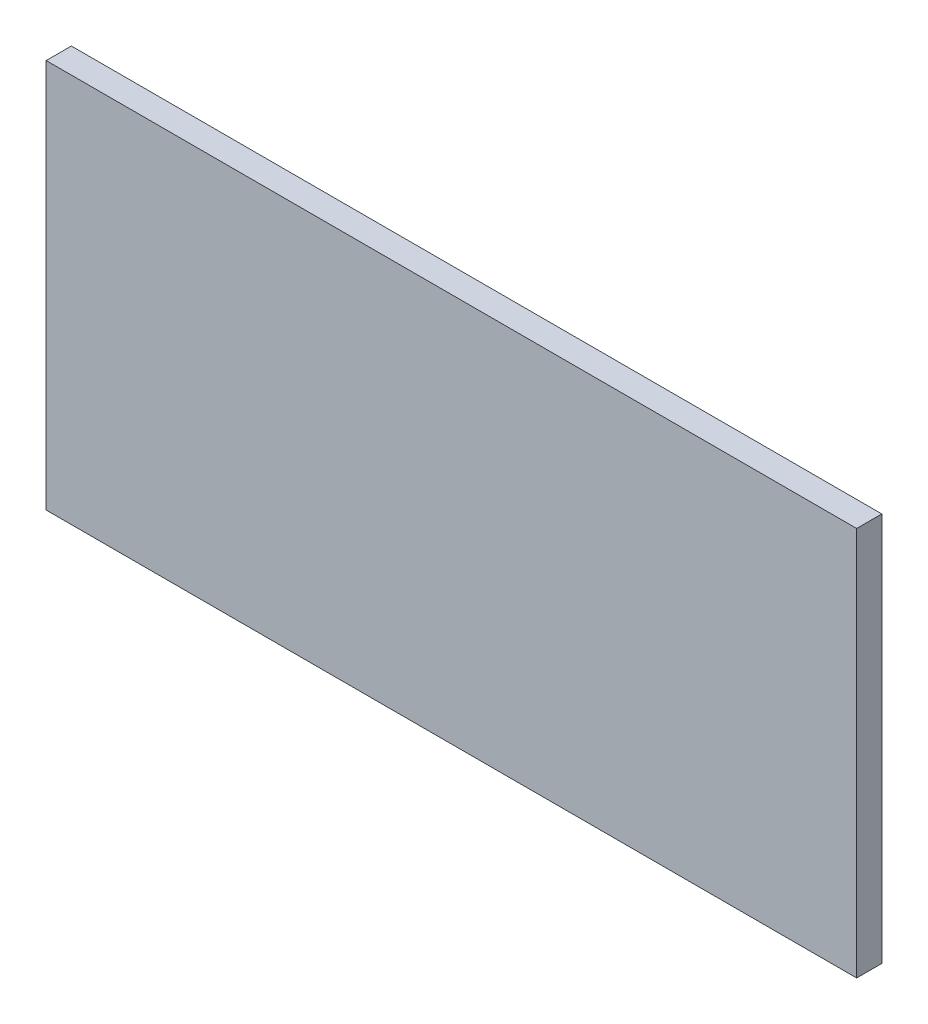
ISO-10303-21;
HEADER;
FILE_DESCRIPTION(('STEP AP214'),'2;1');
FILE_NAME('part.step','',(''),(''),'','','');
FILE_SCHEMA(('AUTOMOTIVE_DESIGN { 1 0 10303 214 1 1 1 1 }'));
ENDSEC;
DATA;
#1=APPLICATION_CONTEXT('core data for automotive mechanical design processes');
#2=APPLICATION_PROTOCOL_DEFINITION('international standard','automotive_design',2000,#1);
#3=PRODUCT_CONTEXT('',#1,'mechanical');
#4=PRODUCT('Part','Part','',(#3));
#5=PRODUCT_RELATED_PRODUCT_CATEGORY('part','',(#4));
#6=PRODUCT_DEFINITION_FORMATION('','',#4);
#7=PRODUCT_DEFINITION_CONTEXT('part definition',#1,'design');
#8=PRODUCT_DEFINITION('design','',#6,#7);
#9=PRODUCT_DEFINITION_SHAPE('','',#8);
#10=(LENGTH_UNIT() NAMED_UNIT(*) SI_UNIT(.MILLI.,.METRE.));
#11=(NAMED_UNIT(*) PLANE_ANGLE_UNIT() SI_UNIT($,.RADIAN.));
#12=(NAMED_UNIT(*) SI_UNIT($,.STERADIAN.) SOLID_ANGLE_UNIT());
#13=UNCERTAINTY_MEASURE_WITH_UNIT(LENGTH_MEASURE(1.E-05),#10,'distance_accuracy_value','');
#14=(GEOMETRIC_REPRESENTATION_CONTEXT(3) GLOBAL_UNCERTAINTY_ASSIGNED_CONTEXT((#13)) GLOBAL_UNIT_ASSIGNED_CONTEXT((#10,
#11,#12)) REPRESENTATION_CONTEXT('',''));
#15=CARTESIAN_POINT('',(0.,0.,0.));
#16=DIRECTION('',(0.,0.,1.));
#17=DIRECTION('',(1.,0.,0.));
#18=AXIS2_PLACEMENT_3D('',#15,#16,#17);
#19=CARTESIAN_POINT('',(86.6470031738281,100.912002563477,0.));
#20=DIRECTION('',(0.,1.,0.));
#21=DIRECTION('',(1.,0.,0.));
#22=AXIS2_PLACEMENT_3D('',#19,#20,#21);
#23=PLANE('',#22);
#24=DIRECTION('',(1.,0.,0.));
#25=VECTOR('',#24,1.);
#26=CARTESIAN_POINT('',(86.6470031738281,100.912002563477,0.03556));
#27=LINE('',#26,#25);
#28=CARTESIAN_POINT('',(86.6470031738281,100.912002563477,0.03556));
#29=VERTEX_POINT('',#28);
#30=CARTESIAN_POINT('',(87.7919998168945,100.912002563477,0.03556));
#31=VERTEX_POINT('',#30);
#32=EDGE_CURVE('E11',#29,#31,#27,.T.);
#33=ORIENTED_EDGE('',*,*,#32,.F.);
#34=DIRECTION('',(0.,0.,1.));
#35=VECTOR('',#34,1.);
#36=CARTESIAN_POINT('',(86.6470031738281,100.912002563477,0.));
#37=LINE('',#36,#35);
#38=CARTESIAN_POINT('',(86.6470031738281,100.912002563477,0.));
#39=VERTEX_POINT('',#38);
#40=EDGE_CURVE('E24',#39,#29,#37,.T.);
#41=ORIENTED_EDGE('',*,*,#40,.F.);
#42=DIRECTION('',(1.,0.,0.));
#43=VECTOR('',#42,1.);
#44=CARTESIAN_POINT('',(86.6470031738281,100.912002563477,0.));
#45=LINE('',#44,#43);
#46=CARTESIAN_POINT('',(87.7919998168945,100.912002563477,0.));
#47=VERTEX_POINT('',#46);
#48=EDGE_CURVE('E75',#39,#47,#45,.T.);
#49=ORIENTED_EDGE('',*,*,#48,.T.);
#50=DIRECTION('',(0.,0.,1.));
#51=VECTOR('',#50,1.);
#52=CARTESIAN_POINT('',(87.7919998168945,100.912002563477,0.));
#53=LINE('',#52,#51);
#54=EDGE_CURVE('E37',#47,#31,#53,.T.);
#55=ORIENTED_EDGE('',*,*,#54,.T.);
#56=EDGE_LOOP('',(#33,#41,#49,#55));
#57=FACE_BOUND('',#56,.T.);
#58=ADVANCED_FACE('F17',(#57),#23,.F.);
#59=CARTESIAN_POINT('',(87.7919998168945,100.912002563477,0.));
#60=DIRECTION('',(-1.,0.,0.));
#61=DIRECTION('',(0.,1.,0.));
#62=AXIS2_PLACEMENT_3D('',#59,#60,#61);
#63=PLANE('',#62);
#64=DIRECTION('',(0.,1.,0.));
#65=VECTOR('',#64,1.);
#66=CARTESIAN_POINT('',(87.7919998168945,100.912002563477,0.03556));
#67=LINE('',#66,#65);
#68=CARTESIAN_POINT('',(87.7919998168945,101.46199798584,0.03556));
#69=VERTEX_POINT('',#68);
#70=EDGE_CURVE('E83',#31,#69,#67,.T.);
#71=ORIENTED_EDGE('',*,*,#70,.F.);
#72=ORIENTED_EDGE('',*,*,#54,.F.);
#73=DIRECTION('',(0.,1.,0.));
#74=VECTOR('',#73,1.);
#75=CARTESIAN_POINT('',(87.7919998168945,100.912002563477,0.));
#76=LINE('',#75,#74);
#77=CARTESIAN_POINT('',(87.7919998168945,101.46199798584,0.));
#78=VERTEX_POINT('',#77);
#79=EDGE_CURVE('E81',#47,#78,#76,.T.);
#80=ORIENTED_EDGE('',*,*,#79,.T.);
#81=DIRECTION('',(0.,0.,1.));
#82=VECTOR('',#81,1.);
#83=CARTESIAN_POINT('',(87.7919998168945,101.46199798584,0.));
#84=LINE('',#83,#82);
#85=EDGE_CURVE('E67',#78,#69,#84,.T.);
#86=ORIENTED_EDGE('',*,*,#85,.T.);
#87=EDGE_LOOP('',(#71,#72,#80,#86));
#88=FACE_BOUND('',#87,.T.);
#89=ADVANCED_FACE('F89',(#88),#63,.F.);
#90=CARTESIAN_POINT('',(87.7919998168945,101.46199798584,0.));
#91=DIRECTION('',(0.,-1.,0.));
#92=DIRECTION('',(-1.,0.,0.));
#93=AXIS2_PLACEMENT_3D('',#90,#91,#92);
#94=PLANE('',#93);
#95=DIRECTION('',(-1.,0.,0.));
#96=VECTOR('',#95,1.);
#97=CARTESIAN_POINT('',(87.7919998168945,101.46199798584,0.03556));
#98=LINE('',#97,#96);
#99=CARTESIAN_POINT('',(86.6470031738281,101.46199798584,0.03556));
#100=VERTEX_POINT('',#99);
#101=EDGE_CURVE('E71',#69,#100,#98,.T.);
#102=ORIENTED_EDGE('',*,*,#101,.F.);
#103=ORIENTED_EDGE('',*,*,#85,.F.);
#104=DIRECTION('',(-1.,0.,0.));
#105=VECTOR('',#104,1.);
#106=CARTESIAN_POINT('',(87.7919998168945,101.46199798584,0.));
#107=LINE('',#106,#105);
#108=CARTESIAN_POINT('',(86.6470031738281,101.46199798584,0.));
#109=VERTEX_POINT('',#108);
#110=EDGE_CURVE('E63',#78,#109,#107,.T.);
#111=ORIENTED_EDGE('',*,*,#110,.T.);
#112=DIRECTION('',(0.,0.,1.));
#113=VECTOR('',#112,1.);
#114=CARTESIAN_POINT('',(86.6470031738281,101.46199798584,0.));
#115=LINE('',#114,#113);
#116=EDGE_CURVE('E53',#109,#100,#115,.T.);
#117=ORIENTED_EDGE('',*,*,#116,.T.);
#118=EDGE_LOOP('',(#102,#103,#111,#117));
#119=FACE_BOUND('',#118,.T.);
#120=ADVANCED_FACE('F66',(#119),#94,.F.);
#121=CARTESIAN_POINT('',(86.6470031738281,101.46199798584,0.));
#122=DIRECTION('',(1.,0.,0.));
#123=DIRECTION('',(0.,-1.,0.));
#124=AXIS2_PLACEMENT_3D('',#121,#122,#123);
#125=PLANE('',#124);
#126=DIRECTION('',(0.,-1.,0.));
#127=VECTOR('',#126,1.);
#128=CARTESIAN_POINT('',(86.6470031738281,101.46199798584,0.03556));
#129=LINE('',#128,#127);
#130=EDGE_CURVE('E59',#100,#29,#129,.T.);
#131=ORIENTED_EDGE('',*,*,#130,.F.);
#132=ORIENTED_EDGE('',*,*,#116,.F.);
#133=DIRECTION('',(0.,-1.,0.));
#134=VECTOR('',#133,1.);
#135=CARTESIAN_POINT('',(86.6470031738281,101.46199798584,0.));
#136=LINE('',#135,#134);
#137=EDGE_CURVE('E57',#109,#39,#136,.T.);
#138=ORIENTED_EDGE('',*,*,#137,.T.);
#139=ORIENTED_EDGE('',*,*,#40,.T.);
#140=EDGE_LOOP('',(#131,#132,#138,#139));
#141=FACE_BOUND('',#140,.T.);
#142=ADVANCED_FACE('F55',(#141),#125,.F.);
#143=CARTESIAN_POINT('',(86.6470031738281,100.912002563477,0.));
#144=DIRECTION('',(0.,0.,-1.));
#145=DIRECTION('',(-1.,0.,0.));
#146=AXIS2_PLACEMENT_3D('',#143,#144,#145);
#147=PLANE('',#146);
#148=ORIENTED_EDGE('',*,*,#137,.F.);
#149=ORIENTED_EDGE('',*,*,#110,.F.);
#150=ORIENTED_EDGE('',*,*,#79,.F.);
#151=ORIENTED_EDGE('',*,*,#48,.F.);
#152=EDGE_LOOP('',(#148,#149,#150,#151));
#153=FACE_BOUND('',#152,.T.);
#154=ADVANCED_FACE('F74',(#153),#147,.T.);
#155=CARTESIAN_POINT('',(86.6470031738281,100.912002563477,0.03556));
#156=DIRECTION('',(0.,0.,-1.));
#157=DIRECTION('',(-1.,0.,0.));
#158=AXIS2_PLACEMENT_3D('',#155,#156,#157);
#159=PLANE('',#158);
#160=ORIENTED_EDGE('',*,*,#32,.T.);
#161=ORIENTED_EDGE('',*,*,#70,.T.);
#162=ORIENTED_EDGE('',*,*,#101,.T.);
#163=ORIENTED_EDGE('',*,*,#130,.T.);
#164=EDGE_LOOP('',(#160,#161,#162,#163));
#165=FACE_BOUND('',#164,.T.);
#166=ADVANCED_FACE('F91',(#165),#159,.F.);
#167=CLOSED_SHELL('',(#58,#89,#120,#142,#154,#166));
#168=MANIFOLD_SOLID_BREP('B1',#167);
#169=ADVANCED_BREP_SHAPE_REPRESENTATION('',(#18,#168),#14);
#170=SHAPE_DEFINITION_REPRESENTATION(#9,#169);
ENDSEC;
END-ISO-10303-21;
